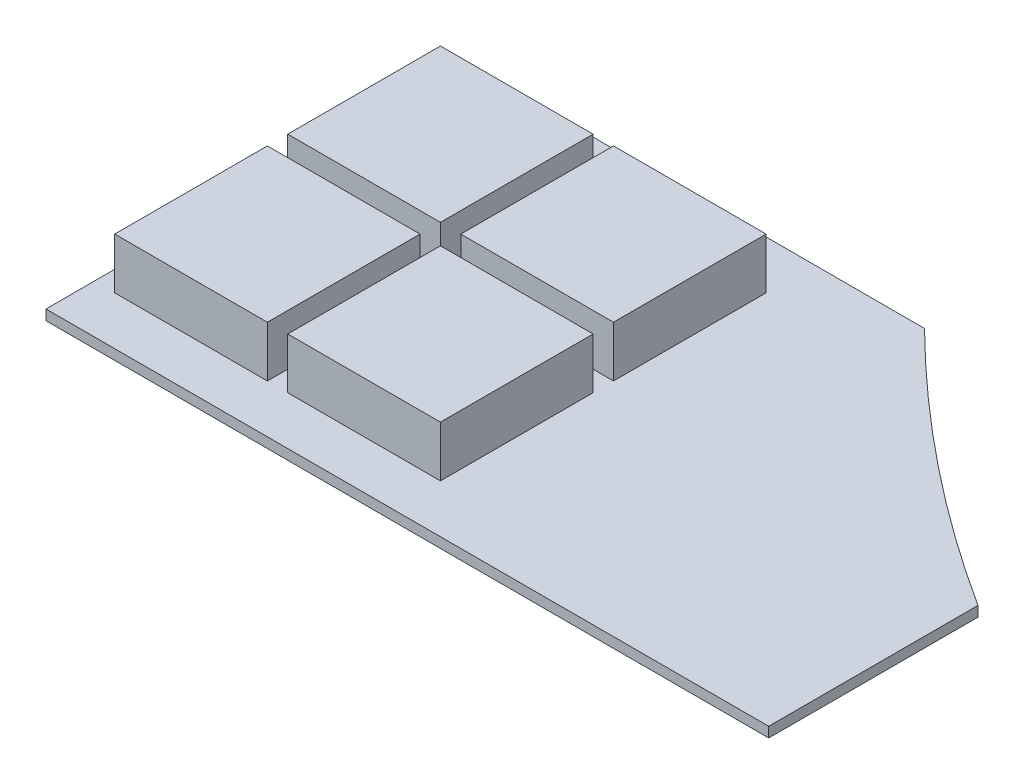
ISO-10303-21;
HEADER;
FILE_DESCRIPTION(('STEP AP214'),'2;1');
FILE_NAME('part.step','',(''),(''),'','','');
FILE_SCHEMA(('AUTOMOTIVE_DESIGN { 1 0 10303 214 1 1 1 1 }'));
ENDSEC;
DATA;
#1=APPLICATION_CONTEXT('core data for automotive mechanical design processes');
#2=APPLICATION_PROTOCOL_DEFINITION('international standard','automotive_design',2000,#1);
#3=PRODUCT_CONTEXT('',#1,'mechanical');
#4=PRODUCT('Part','Part','',(#3));
#5=PRODUCT_RELATED_PRODUCT_CATEGORY('part','',(#4));
#6=PRODUCT_DEFINITION_FORMATION('','',#4);
#7=PRODUCT_DEFINITION_CONTEXT('part definition',#1,'design');
#8=PRODUCT_DEFINITION('design','',#6,#7);
#9=PRODUCT_DEFINITION_SHAPE('','',#8);
#10=(LENGTH_UNIT() NAMED_UNIT(*) SI_UNIT(.MILLI.,.METRE.));
#11=(NAMED_UNIT(*) PLANE_ANGLE_UNIT() SI_UNIT($,.RADIAN.));
#12=(NAMED_UNIT(*) SI_UNIT($,.STERADIAN.) SOLID_ANGLE_UNIT());
#13=UNCERTAINTY_MEASURE_WITH_UNIT(LENGTH_MEASURE(1.E-05),#10,'distance_accuracy_value','');
#14=(GEOMETRIC_REPRESENTATION_CONTEXT(3) GLOBAL_UNCERTAINTY_ASSIGNED_CONTEXT((#13)) GLOBAL_UNIT_ASSIGNED_CONTEXT((#10,
#11,#12)) REPRESENTATION_CONTEXT('',''));
#15=CARTESIAN_POINT('',(0.,0.,0.));
#16=DIRECTION('',(0.,0.,1.));
#17=DIRECTION('',(1.,0.,0.));
#18=AXIS2_PLACEMENT_3D('',#15,#16,#17);
#19=CARTESIAN_POINT('',(211.09224857648,93.3157017452683,55.768969390047));
#20=DIRECTION('',(0.,1.,0.));
#21=DIRECTION('',(0.,0.,1.));
#22=AXIS2_PLACEMENT_3D('',#19,#20,#21);
#23=PLANE('',#22);
#24=DIRECTION('',(0.,0.,1.));
#25=VECTOR('',#24,1.);
#26=CARTESIAN_POINT('',(269.894917120642,93.3157017452683,82.4989117513526));
#27=LINE('',#26,#25);
#28=CARTESIAN_POINT('',(269.894917120642,93.3157017452683,97.4989117513526));
#29=VERTEX_POINT('',#28);
#30=CARTESIAN_POINT('',(269.894917120642,93.3157017452683,82.4989117513526));
#31=VERTEX_POINT('',#30);
#32=EDGE_CURVE('E305',#29,#31,#27,.F.);
#33=ORIENTED_EDGE('',*,*,#32,.F.);
#34=DIRECTION('',(1.,0.,0.));
#35=VECTOR('',#34,1.);
#36=CARTESIAN_POINT('',(269.894917120642,93.3157017452683,97.4989117513526));
#37=LINE('',#36,#35);
#38=CARTESIAN_POINT('',(284.894917120642,93.3157017452683,97.4989117513526));
#39=VERTEX_POINT('',#38);
#40=EDGE_CURVE('E136',#39,#29,#37,.F.);
#41=ORIENTED_EDGE('',*,*,#40,.F.);
#42=DIRECTION('',(0.,0.,-1.));
#43=VECTOR('',#42,1.);
#44=CARTESIAN_POINT('',(284.894917120642,93.3157017452683,97.4989117513526));
#45=LINE('',#44,#43);
#46=CARTESIAN_POINT('',(284.894917120642,93.3157017452683,82.4989117513526));
#47=VERTEX_POINT('',#46);
#48=EDGE_CURVE('E128',#47,#39,#45,.F.);
#49=ORIENTED_EDGE('',*,*,#48,.F.);
#50=DIRECTION('',(-1.,0.,0.));
#51=VECTOR('',#50,1.);
#52=CARTESIAN_POINT('',(284.894917120642,93.3157017452683,82.4989117513526));
#53=LINE('',#52,#51);
#54=EDGE_CURVE('E116',#31,#47,#53,.F.);
#55=ORIENTED_EDGE('',*,*,#54,.F.);
#56=EDGE_LOOP('',(#33,#41,#49,#55));
#57=FACE_BOUND('',#56,.T.);
#58=ADVANCED_FACE('F17',(#57),#23,.T.);
#59=CARTESIAN_POINT('',(194.09224857648,93.3157017452683,55.768969390047));
#60=DIRECTION('',(0.,1.,0.));
#61=DIRECTION('',(0.,0.,1.));
#62=AXIS2_PLACEMENT_3D('',#59,#60,#61);
#63=PLANE('',#62);
#64=DIRECTION('',(0.,0.,1.));
#65=VECTOR('',#64,1.);
#66=CARTESIAN_POINT('',(252.894917120642,93.3157017452683,82.4989117513526));
#67=LINE('',#66,#65);
#68=CARTESIAN_POINT('',(252.894917120642,93.3157017452683,97.4989117513526));
#69=VERTEX_POINT('',#68);
#70=CARTESIAN_POINT('',(252.894917120642,93.3157017452683,82.4989117513526));
#71=VERTEX_POINT('',#70);
#72=EDGE_CURVE('E299',#69,#71,#67,.F.);
#73=ORIENTED_EDGE('',*,*,#72,.F.);
#74=DIRECTION('',(1.,0.,0.));
#75=VECTOR('',#74,1.);
#76=CARTESIAN_POINT('',(252.894917120642,93.3157017452683,97.4989117513526));
#77=LINE('',#76,#75);
#78=CARTESIAN_POINT('',(267.894917120642,93.3157017452683,97.4989117513526));
#79=VERTEX_POINT('',#78);
#80=EDGE_CURVE('E287',#79,#69,#77,.F.);
#81=ORIENTED_EDGE('',*,*,#80,.F.);
#82=DIRECTION('',(0.,0.,-1.));
#83=VECTOR('',#82,1.);
#84=CARTESIAN_POINT('',(267.894917120642,93.3157017452683,97.4989117513526));
#85=LINE('',#84,#83);
#86=CARTESIAN_POINT('',(267.894917120642,93.3157017452683,82.4989117513526));
#87=VERTEX_POINT('',#86);
#88=EDGE_CURVE('E292',#87,#79,#85,.F.);
#89=ORIENTED_EDGE('',*,*,#88,.F.);
#90=DIRECTION('',(-1.,0.,0.));
#91=VECTOR('',#90,1.);
#92=CARTESIAN_POINT('',(267.894917120642,93.3157017452683,82.4989117513526));
#93=LINE('',#92,#91);
#94=EDGE_CURVE('E297',#71,#87,#93,.F.);
#95=ORIENTED_EDGE('',*,*,#94,.F.);
#96=EDGE_LOOP('',(#73,#81,#89,#95));
#97=FACE_BOUND('',#96,.T.);
#98=ADVANCED_FACE('F422',(#97),#63,.T.);
#99=CARTESIAN_POINT('',(211.09224857648,93.3157017452683,38.768969390047));
#100=DIRECTION('',(0.,1.,0.));
#101=DIRECTION('',(0.,0.,1.));
#102=AXIS2_PLACEMENT_3D('',#99,#100,#101);
#103=PLANE('',#102);
#104=DIRECTION('',(0.,0.,1.));
#105=VECTOR('',#104,1.);
#106=CARTESIAN_POINT('',(269.894917120642,93.3157017452683,65.4989117513526));
#107=LINE('',#106,#105);
#108=CARTESIAN_POINT('',(269.894917120642,93.3157017452683,80.4989117513526));
#109=VERTEX_POINT('',#108);
#110=CARTESIAN_POINT('',(269.894917120642,93.3157017452683,65.4989117513526));
#111=VERTEX_POINT('',#110);
#112=EDGE_CURVE('E272',#109,#111,#107,.F.);
#113=ORIENTED_EDGE('',*,*,#112,.F.);
#114=DIRECTION('',(1.,0.,0.));
#115=VECTOR('',#114,1.);
#116=CARTESIAN_POINT('',(269.894917120642,93.3157017452683,80.4989117513526));
#117=LINE('',#116,#115);
#118=CARTESIAN_POINT('',(284.894917120642,93.3157017452683,80.4989117513526));
#119=VERTEX_POINT('',#118);
#120=EDGE_CURVE('E277',#119,#109,#117,.F.);
#121=ORIENTED_EDGE('',*,*,#120,.F.);
#122=DIRECTION('',(0.,0.,-1.));
#123=VECTOR('',#122,1.);
#124=CARTESIAN_POINT('',(284.894917120642,93.3157017452683,80.4989117513526));
#125=LINE('',#124,#123);
#126=CARTESIAN_POINT('',(284.894917120642,93.3157017452683,65.4989117513526));
#127=VERTEX_POINT('',#126);
#128=EDGE_CURVE('E279',#127,#119,#125,.F.);
#129=ORIENTED_EDGE('',*,*,#128,.F.);
#130=DIRECTION('',(-1.,0.,0.));
#131=VECTOR('',#130,1.);
#132=CARTESIAN_POINT('',(284.894917120642,93.3157017452683,65.4989117513526));
#133=LINE('',#132,#131);
#134=EDGE_CURVE('E267',#111,#127,#133,.F.);
#135=ORIENTED_EDGE('',*,*,#134,.F.);
#136=EDGE_LOOP('',(#113,#121,#129,#135));
#137=FACE_BOUND('',#136,.T.);
#138=ADVANCED_FACE('F419',(#137),#103,.T.);
#139=CARTESIAN_POINT('',(194.09224857648,93.3157017452683,38.768969390047));
#140=DIRECTION('',(0.,1.,0.));
#141=DIRECTION('',(0.,0.,1.));
#142=AXIS2_PLACEMENT_3D('',#139,#140,#141);
#143=PLANE('',#142);
#144=DIRECTION('',(0.,0.,1.));
#145=VECTOR('',#144,1.);
#146=CARTESIAN_POINT('',(252.894917120642,93.3157017452683,65.4989117513526));
#147=LINE('',#146,#145);
#148=CARTESIAN_POINT('',(252.894917120642,93.3157017452683,80.4989117513526));
#149=VERTEX_POINT('',#148);
#150=CARTESIAN_POINT('',(252.894917120642,93.3157017452683,65.4989117513526));
#151=VERTEX_POINT('',#150);
#152=EDGE_CURVE('E259',#149,#151,#147,.F.);
#153=ORIENTED_EDGE('',*,*,#152,.F.);
#154=DIRECTION('',(1.,0.,0.));
#155=VECTOR('',#154,1.);
#156=CARTESIAN_POINT('',(252.894917120642,93.3157017452683,80.4989117513526));
#157=LINE('',#156,#155);
#158=CARTESIAN_POINT('',(267.894917120642,93.3157017452683,80.4989117513526));
#159=VERTEX_POINT('',#158);
#160=EDGE_CURVE('E247',#159,#149,#157,.F.);
#161=ORIENTED_EDGE('',*,*,#160,.F.);
#162=DIRECTION('',(0.,0.,-1.));
#163=VECTOR('',#162,1.);
#164=CARTESIAN_POINT('',(267.894917120642,93.3157017452683,80.4989117513526));
#165=LINE('',#164,#163);
#166=CARTESIAN_POINT('',(267.894917120642,93.3157017452683,65.4989117513526));
#167=VERTEX_POINT('',#166);
#168=EDGE_CURVE('E252',#167,#159,#165,.F.);
#169=ORIENTED_EDGE('',*,*,#168,.F.);
#170=DIRECTION('',(-1.,0.,0.));
#171=VECTOR('',#170,1.);
#172=CARTESIAN_POINT('',(267.894917120642,93.3157017452683,65.4989117513526));
#173=LINE('',#172,#171);
#174=EDGE_CURVE('E257',#151,#167,#173,.F.);
#175=ORIENTED_EDGE('',*,*,#174,.F.);
#176=EDGE_LOOP('',(#153,#161,#169,#175));
#177=FACE_BOUND('',#176,.T.);
#178=ADVANCED_FACE('F416',(#177),#143,.T.);
#179=CARTESIAN_POINT('',(284.894917120642,93.3157017452683,82.4989117513526));
#180=DIRECTION('',(0.,0.,-1.));
#181=DIRECTION('',(-1.,0.,0.));
#182=AXIS2_PLACEMENT_3D('',#179,#180,#181);
#183=PLANE('',#182);
#184=DIRECTION('',(1.,0.,0.));
#185=VECTOR('',#184,1.);
#186=CARTESIAN_POINT('',(627.09224857648,88.3157017452683,82.4989117513526));
#187=LINE('',#186,#185);
#188=CARTESIAN_POINT('',(269.894917120642,88.3157017452683,82.4989117513526));
#189=VERTEX_POINT('',#188);
#190=CARTESIAN_POINT('',(284.894917120642,88.3157017452683,82.4989117513526));
#191=VERTEX_POINT('',#190);
#192=EDGE_CURVE('E226',#189,#191,#187,.T.);
#193=ORIENTED_EDGE('',*,*,#192,.F.);
#194=DIRECTION('',(0.,1.,0.));
#195=VECTOR('',#194,1.);
#196=CARTESIAN_POINT('',(269.894917120642,93.3157017452683,82.4989117513526));
#197=LINE('',#196,#195);
#198=EDGE_CURVE('E124',#31,#189,#197,.F.);
#199=ORIENTED_EDGE('',*,*,#198,.F.);
#200=ORIENTED_EDGE('',*,*,#54,.T.);
#201=DIRECTION('',(0.,1.,0.));
#202=VECTOR('',#201,1.);
#203=CARTESIAN_POINT('',(284.894917120642,93.3157017452683,82.4989117513526));
#204=LINE('',#203,#202);
#205=EDGE_CURVE('E121',#191,#47,#204,.T.);
#206=ORIENTED_EDGE('',*,*,#205,.F.);
#207=EDGE_LOOP('',(#193,#199,#200,#206));
#208=FACE_BOUND('',#207,.T.);
#209=ADVANCED_FACE('F119',(#208),#183,.T.);
#210=CARTESIAN_POINT('',(284.894917120642,93.3157017452683,97.4989117513526));
#211=DIRECTION('',(1.,0.,0.));
#212=DIRECTION('',(0.,0.,-1.));
#213=AXIS2_PLACEMENT_3D('',#210,#211,#212);
#214=PLANE('',#213);
#215=DIRECTION('',(0.,0.,1.));
#216=VECTOR('',#215,1.);
#217=CARTESIAN_POINT('',(284.894917120642,88.3157017452683,38.768969390047));
#218=LINE('',#217,#216);
#219=CARTESIAN_POINT('',(284.894917120642,88.3157017452683,97.4989117513526));
#220=VERTEX_POINT('',#219);
#221=EDGE_CURVE('E135',#191,#220,#218,.T.);
#222=ORIENTED_EDGE('',*,*,#221,.F.);
#223=ORIENTED_EDGE('',*,*,#205,.T.);
#224=ORIENTED_EDGE('',*,*,#48,.T.);
#225=DIRECTION('',(0.,1.,0.));
#226=VECTOR('',#225,1.);
#227=CARTESIAN_POINT('',(284.894917120642,93.3157017452683,97.4989117513526));
#228=LINE('',#227,#226);
#229=EDGE_CURVE('E307',#220,#39,#228,.T.);
#230=ORIENTED_EDGE('',*,*,#229,.F.);
#231=EDGE_LOOP('',(#222,#223,#224,#230));
#232=FACE_BOUND('',#231,.T.);
#233=ADVANCED_FACE('F131',(#232),#214,.T.);
#234=CARTESIAN_POINT('',(269.894917120642,93.3157017452683,97.4989117513526));
#235=DIRECTION('',(0.,0.,1.));
#236=DIRECTION('',(1.,0.,0.));
#237=AXIS2_PLACEMENT_3D('',#234,#235,#236);
#238=PLANE('',#237);
#239=DIRECTION('',(1.,0.,0.));
#240=VECTOR('',#239,1.);
#241=CARTESIAN_POINT('',(627.09224857648,88.3157017452683,97.4989117513526));
#242=LINE('',#241,#240);
#243=CARTESIAN_POINT('',(269.894917120642,88.3157017452683,97.4989117513526));
#244=VERTEX_POINT('',#243);
#245=EDGE_CURVE('E222',#220,#244,#242,.F.);
#246=ORIENTED_EDGE('',*,*,#245,.F.);
#247=ORIENTED_EDGE('',*,*,#229,.T.);
#248=ORIENTED_EDGE('',*,*,#40,.T.);
#249=DIRECTION('',(0.,1.,0.));
#250=VECTOR('',#249,1.);
#251=CARTESIAN_POINT('',(269.894917120642,93.3157017452683,97.4989117513526));
#252=LINE('',#251,#250);
#253=EDGE_CURVE('E301',#244,#29,#252,.T.);
#254=ORIENTED_EDGE('',*,*,#253,.F.);
#255=EDGE_LOOP('',(#246,#247,#248,#254));
#256=FACE_BOUND('',#255,.T.);
#257=ADVANCED_FACE('F311',(#256),#238,.T.);
#258=CARTESIAN_POINT('',(269.894917120642,93.3157017452683,82.4989117513526));
#259=DIRECTION('',(-1.,0.,0.));
#260=DIRECTION('',(0.,0.,1.));
#261=AXIS2_PLACEMENT_3D('',#258,#259,#260);
#262=PLANE('',#261);
#263=DIRECTION('',(0.,0.,1.));
#264=VECTOR('',#263,1.);
#265=CARTESIAN_POINT('',(269.894917120642,88.3157017452683,38.768969390047));
#266=LINE('',#265,#264);
#267=EDGE_CURVE('E219',#244,#189,#266,.F.);
#268=ORIENTED_EDGE('',*,*,#267,.F.);
#269=ORIENTED_EDGE('',*,*,#253,.T.);
#270=ORIENTED_EDGE('',*,*,#32,.T.);
#271=ORIENTED_EDGE('',*,*,#198,.T.);
#272=EDGE_LOOP('',(#268,#269,#270,#271));
#273=FACE_BOUND('',#272,.T.);
#274=ADVANCED_FACE('F315',(#273),#262,.T.);
#275=CARTESIAN_POINT('',(252.894917120642,93.3157017452683,82.4989117513526));
#276=DIRECTION('',(-1.,0.,0.));
#277=DIRECTION('',(0.,0.,1.));
#278=AXIS2_PLACEMENT_3D('',#275,#276,#277);
#279=PLANE('',#278);
#280=DIRECTION('',(0.,0.,1.));
#281=VECTOR('',#280,1.);
#282=CARTESIAN_POINT('',(252.894917120642,88.3157017452683,38.768969390047));
#283=LINE('',#282,#281);
#284=CARTESIAN_POINT('',(252.894917120642,88.3157017452683,97.4989117513526));
#285=VERTEX_POINT('',#284);
#286=CARTESIAN_POINT('',(252.894917120642,88.3157017452683,82.4989117513526));
#287=VERTEX_POINT('',#286);
#288=EDGE_CURVE('E216',#285,#287,#283,.F.);
#289=ORIENTED_EDGE('',*,*,#288,.F.);
#290=DIRECTION('',(0.,1.,0.));
#291=VECTOR('',#290,1.);
#292=CARTESIAN_POINT('',(252.894917120642,93.3157017452683,97.4989117513526));
#293=LINE('',#292,#291);
#294=EDGE_CURVE('E284',#69,#285,#293,.F.);
#295=ORIENTED_EDGE('',*,*,#294,.F.);
#296=ORIENTED_EDGE('',*,*,#72,.T.);
#297=DIRECTION('',(0.,1.,0.));
#298=VECTOR('',#297,1.);
#299=CARTESIAN_POINT('',(252.894917120642,93.3157017452683,82.4989117513526));
#300=LINE('',#299,#298);
#301=EDGE_CURVE('E294',#287,#71,#300,.T.);
#302=ORIENTED_EDGE('',*,*,#301,.F.);
#303=EDGE_LOOP('',(#289,#295,#296,#302));
#304=FACE_BOUND('',#303,.T.);
#305=ADVANCED_FACE('F403',(#304),#279,.T.);
#306=CARTESIAN_POINT('',(267.894917120642,93.3157017452683,82.4989117513526));
#307=DIRECTION('',(0.,0.,-1.));
#308=DIRECTION('',(-1.,0.,0.));
#309=AXIS2_PLACEMENT_3D('',#306,#307,#308);
#310=PLANE('',#309);
#311=DIRECTION('',(1.,0.,0.));
#312=VECTOR('',#311,1.);
#313=CARTESIAN_POINT('',(627.09224857648,88.3157017452683,82.4989117513526));
#314=LINE('',#313,#312);
#315=CARTESIAN_POINT('',(267.894917120642,88.3157017452683,82.4989117513526));
#316=VERTEX_POINT('',#315);
#317=EDGE_CURVE('E213',#287,#316,#314,.T.);
#318=ORIENTED_EDGE('',*,*,#317,.F.);
#319=ORIENTED_EDGE('',*,*,#301,.T.);
#320=ORIENTED_EDGE('',*,*,#94,.T.);
#321=DIRECTION('',(0.,1.,0.));
#322=VECTOR('',#321,1.);
#323=CARTESIAN_POINT('',(267.894917120642,93.3157017452683,82.4989117513526));
#324=LINE('',#323,#322);
#325=EDGE_CURVE('E289',#316,#87,#324,.T.);
#326=ORIENTED_EDGE('',*,*,#325,.F.);
#327=EDGE_LOOP('',(#318,#319,#320,#326));
#328=FACE_BOUND('',#327,.T.);
#329=ADVANCED_FACE('F399',(#328),#310,.T.);
#330=CARTESIAN_POINT('',(267.894917120642,93.3157017452683,97.4989117513526));
#331=DIRECTION('',(1.,0.,0.));
#332=DIRECTION('',(0.,0.,-1.));
#333=AXIS2_PLACEMENT_3D('',#330,#331,#332);
#334=PLANE('',#333);
#335=DIRECTION('',(0.,0.,1.));
#336=VECTOR('',#335,1.);
#337=CARTESIAN_POINT('',(267.894917120642,88.3157017452683,38.768969390047));
#338=LINE('',#337,#336);
#339=CARTESIAN_POINT('',(267.894917120642,88.3157017452683,97.4989117513526));
#340=VERTEX_POINT('',#339);
#341=EDGE_CURVE('E210',#316,#340,#338,.T.);
#342=ORIENTED_EDGE('',*,*,#341,.F.);
#343=ORIENTED_EDGE('',*,*,#325,.T.);
#344=ORIENTED_EDGE('',*,*,#88,.T.);
#345=DIRECTION('',(0.,1.,0.));
#346=VECTOR('',#345,1.);
#347=CARTESIAN_POINT('',(267.894917120642,93.3157017452683,97.4989117513526));
#348=LINE('',#347,#346);
#349=EDGE_CURVE('E281',#340,#79,#348,.T.);
#350=ORIENTED_EDGE('',*,*,#349,.F.);
#351=EDGE_LOOP('',(#342,#343,#344,#350));
#352=FACE_BOUND('',#351,.T.);
#353=ADVANCED_FACE('F395',(#352),#334,.T.);
#354=CARTESIAN_POINT('',(252.894917120642,93.3157017452683,97.4989117513526));
#355=DIRECTION('',(0.,0.,1.));
#356=DIRECTION('',(1.,0.,0.));
#357=AXIS2_PLACEMENT_3D('',#354,#355,#356);
#358=PLANE('',#357);
#359=DIRECTION('',(1.,0.,0.));
#360=VECTOR('',#359,1.);
#361=CARTESIAN_POINT('',(627.09224857648,88.3157017452683,97.4989117513526));
#362=LINE('',#361,#360);
#363=EDGE_CURVE('E207',#340,#285,#362,.F.);
#364=ORIENTED_EDGE('',*,*,#363,.F.);
#365=ORIENTED_EDGE('',*,*,#349,.T.);
#366=ORIENTED_EDGE('',*,*,#80,.T.);
#367=ORIENTED_EDGE('',*,*,#294,.T.);
#368=EDGE_LOOP('',(#364,#365,#366,#367));
#369=FACE_BOUND('',#368,.T.);
#370=ADVANCED_FACE('F391',(#369),#358,.T.);
#371=CARTESIAN_POINT('',(284.894917120642,93.3157017452683,80.4989117513526));
#372=DIRECTION('',(1.,0.,0.));
#373=DIRECTION('',(0.,0.,-1.));
#374=AXIS2_PLACEMENT_3D('',#371,#372,#373);
#375=PLANE('',#374);
#376=DIRECTION('',(0.,0.,1.));
#377=VECTOR('',#376,1.);
#378=CARTESIAN_POINT('',(284.894917120642,88.3157017452683,38.768969390047));
#379=LINE('',#378,#377);
#380=CARTESIAN_POINT('',(284.894917120642,88.3157017452683,65.4989117513526));
#381=VERTEX_POINT('',#380);
#382=CARTESIAN_POINT('',(284.894917120642,88.3157017452683,80.4989117513526));
#383=VERTEX_POINT('',#382);
#384=EDGE_CURVE('E204',#381,#383,#379,.T.);
#385=ORIENTED_EDGE('',*,*,#384,.F.);
#386=DIRECTION('',(0.,1.,0.));
#387=VECTOR('',#386,1.);
#388=CARTESIAN_POINT('',(284.894917120642,93.3157017452683,65.4989117513526));
#389=LINE('',#388,#387);
#390=EDGE_CURVE('E264',#127,#381,#389,.F.);
#391=ORIENTED_EDGE('',*,*,#390,.F.);
#392=ORIENTED_EDGE('',*,*,#128,.T.);
#393=DIRECTION('',(0.,1.,0.));
#394=VECTOR('',#393,1.);
#395=CARTESIAN_POINT('',(284.894917120642,93.3157017452683,80.4989117513526));
#396=LINE('',#395,#394);
#397=EDGE_CURVE('E274',#383,#119,#396,.T.);
#398=ORIENTED_EDGE('',*,*,#397,.F.);
#399=EDGE_LOOP('',(#385,#391,#392,#398));
#400=FACE_BOUND('',#399,.T.);
#401=ADVANCED_FACE('F387',(#400),#375,.T.);
#402=CARTESIAN_POINT('',(269.894917120642,93.3157017452683,80.4989117513526));
#403=DIRECTION('',(0.,0.,1.));
#404=DIRECTION('',(1.,0.,0.));
#405=AXIS2_PLACEMENT_3D('',#402,#403,#404);
#406=PLANE('',#405);
#407=DIRECTION('',(1.,0.,0.));
#408=VECTOR('',#407,1.);
#409=CARTESIAN_POINT('',(627.09224857648,88.3157017452683,80.4989117513526));
#410=LINE('',#409,#408);
#411=CARTESIAN_POINT('',(269.894917120642,88.3157017452683,80.4989117513526));
#412=VERTEX_POINT('',#411);
#413=EDGE_CURVE('E201',#383,#412,#410,.F.);
#414=ORIENTED_EDGE('',*,*,#413,.F.);
#415=ORIENTED_EDGE('',*,*,#397,.T.);
#416=ORIENTED_EDGE('',*,*,#120,.T.);
#417=DIRECTION('',(0.,1.,0.));
#418=VECTOR('',#417,1.);
#419=CARTESIAN_POINT('',(269.894917120642,93.3157017452683,80.4989117513526));
#420=LINE('',#419,#418);
#421=EDGE_CURVE('E269',#412,#109,#420,.T.);
#422=ORIENTED_EDGE('',*,*,#421,.F.);
#423=EDGE_LOOP('',(#414,#415,#416,#422));
#424=FACE_BOUND('',#423,.T.);
#425=ADVANCED_FACE('F383',(#424),#406,.T.);
#426=CARTESIAN_POINT('',(269.894917120642,93.3157017452683,65.4989117513526));
#427=DIRECTION('',(-1.,0.,0.));
#428=DIRECTION('',(0.,0.,1.));
#429=AXIS2_PLACEMENT_3D('',#426,#427,#428);
#430=PLANE('',#429);
#431=DIRECTION('',(0.,0.,1.));
#432=VECTOR('',#431,1.);
#433=CARTESIAN_POINT('',(269.894917120642,88.3157017452683,38.768969390047));
#434=LINE('',#433,#432);
#435=CARTESIAN_POINT('',(269.894917120642,88.3157017452683,65.4989117513526));
#436=VERTEX_POINT('',#435);
#437=EDGE_CURVE('E198',#412,#436,#434,.F.);
#438=ORIENTED_EDGE('',*,*,#437,.F.);
#439=ORIENTED_EDGE('',*,*,#421,.T.);
#440=ORIENTED_EDGE('',*,*,#112,.T.);
#441=DIRECTION('',(0.,1.,0.));
#442=VECTOR('',#441,1.);
#443=CARTESIAN_POINT('',(269.894917120642,93.3157017452683,65.4989117513526));
#444=LINE('',#443,#442);
#445=EDGE_CURVE('E261',#436,#111,#444,.T.);
#446=ORIENTED_EDGE('',*,*,#445,.F.);
#447=EDGE_LOOP('',(#438,#439,#440,#446));
#448=FACE_BOUND('',#447,.T.);
#449=ADVANCED_FACE('F379',(#448),#430,.T.);
#450=CARTESIAN_POINT('',(284.894917120642,93.3157017452683,65.4989117513526));
#451=DIRECTION('',(0.,0.,-1.));
#452=DIRECTION('',(-1.,0.,0.));
#453=AXIS2_PLACEMENT_3D('',#450,#451,#452);
#454=PLANE('',#453);
#455=DIRECTION('',(1.,0.,0.));
#456=VECTOR('',#455,1.);
#457=CARTESIAN_POINT('',(627.09224857648,88.3157017452683,65.4989117513526));
#458=LINE('',#457,#456);
#459=EDGE_CURVE('E195',#436,#381,#458,.T.);
#460=ORIENTED_EDGE('',*,*,#459,.F.);
#461=ORIENTED_EDGE('',*,*,#445,.T.);
#462=ORIENTED_EDGE('',*,*,#134,.T.);
#463=ORIENTED_EDGE('',*,*,#390,.T.);
#464=EDGE_LOOP('',(#460,#461,#462,#463));
#465=FACE_BOUND('',#464,.T.);
#466=ADVANCED_FACE('F375',(#465),#454,.T.);
#467=CARTESIAN_POINT('',(252.894917120642,93.3157017452683,65.4989117513526));
#468=DIRECTION('',(-1.,0.,0.));
#469=DIRECTION('',(0.,0.,1.));
#470=AXIS2_PLACEMENT_3D('',#467,#468,#469);
#471=PLANE('',#470);
#472=DIRECTION('',(0.,0.,1.));
#473=VECTOR('',#472,1.);
#474=CARTESIAN_POINT('',(252.894917120642,88.3157017452683,38.768969390047));
#475=LINE('',#474,#473);
#476=CARTESIAN_POINT('',(252.894917120642,88.3157017452683,80.4989117513526));
#477=VERTEX_POINT('',#476);
#478=CARTESIAN_POINT('',(252.894917120642,88.3157017452683,65.4989117513526));
#479=VERTEX_POINT('',#478);
#480=EDGE_CURVE('E192',#477,#479,#475,.F.);
#481=ORIENTED_EDGE('',*,*,#480,.F.);
#482=DIRECTION('',(0.,1.,0.));
#483=VECTOR('',#482,1.);
#484=CARTESIAN_POINT('',(252.894917120642,93.3157017452683,80.4989117513526));
#485=LINE('',#484,#483);
#486=EDGE_CURVE('E244',#149,#477,#485,.F.);
#487=ORIENTED_EDGE('',*,*,#486,.F.);
#488=ORIENTED_EDGE('',*,*,#152,.T.);
#489=DIRECTION('',(0.,1.,0.));
#490=VECTOR('',#489,1.);
#491=CARTESIAN_POINT('',(252.894917120642,93.3157017452683,65.4989117513526));
#492=LINE('',#491,#490);
#493=EDGE_CURVE('E254',#479,#151,#492,.T.);
#494=ORIENTED_EDGE('',*,*,#493,.F.);
#495=EDGE_LOOP('',(#481,#487,#488,#494));
#496=FACE_BOUND('',#495,.T.);
#497=ADVANCED_FACE('F371',(#496),#471,.T.);
#498=CARTESIAN_POINT('',(267.894917120642,93.3157017452683,65.4989117513526));
#499=DIRECTION('',(0.,0.,-1.));
#500=DIRECTION('',(-1.,0.,0.));
#501=AXIS2_PLACEMENT_3D('',#498,#499,#500);
#502=PLANE('',#501);
#503=DIRECTION('',(1.,0.,0.));
#504=VECTOR('',#503,1.);
#505=CARTESIAN_POINT('',(627.09224857648,88.3157017452683,65.4989117513526));
#506=LINE('',#505,#504);
#507=CARTESIAN_POINT('',(267.894917120642,88.3157017452683,65.4989117513526));
#508=VERTEX_POINT('',#507);
#509=EDGE_CURVE('E189',#479,#508,#506,.T.);
#510=ORIENTED_EDGE('',*,*,#509,.F.);
#511=ORIENTED_EDGE('',*,*,#493,.T.);
#512=ORIENTED_EDGE('',*,*,#174,.T.);
#513=DIRECTION('',(0.,1.,0.));
#514=VECTOR('',#513,1.);
#515=CARTESIAN_POINT('',(267.894917120642,93.3157017452683,65.4989117513526));
#516=LINE('',#515,#514);
#517=EDGE_CURVE('E249',#508,#167,#516,.T.);
#518=ORIENTED_EDGE('',*,*,#517,.F.);
#519=EDGE_LOOP('',(#510,#511,#512,#518));
#520=FACE_BOUND('',#519,.T.);
#521=ADVANCED_FACE('F367',(#520),#502,.T.);
#522=CARTESIAN_POINT('',(267.894917120642,93.3157017452683,80.4989117513526));
#523=DIRECTION('',(1.,0.,0.));
#524=DIRECTION('',(0.,0.,-1.));
#525=AXIS2_PLACEMENT_3D('',#522,#523,#524);
#526=PLANE('',#525);
#527=DIRECTION('',(0.,0.,1.));
#528=VECTOR('',#527,1.);
#529=CARTESIAN_POINT('',(267.894917120642,88.3157017452683,38.768969390047));
#530=LINE('',#529,#528);
#531=CARTESIAN_POINT('',(267.894917120642,88.3157017452683,80.4989117513526));
#532=VERTEX_POINT('',#531);
#533=EDGE_CURVE('E186',#508,#532,#530,.T.);
#534=ORIENTED_EDGE('',*,*,#533,.F.);
#535=ORIENTED_EDGE('',*,*,#517,.T.);
#536=ORIENTED_EDGE('',*,*,#168,.T.);
#537=DIRECTION('',(0.,1.,0.));
#538=VECTOR('',#537,1.);
#539=CARTESIAN_POINT('',(267.894917120642,93.3157017452683,80.4989117513526));
#540=LINE('',#539,#538);
#541=EDGE_CURVE('E229',#532,#159,#540,.T.);
#542=ORIENTED_EDGE('',*,*,#541,.F.);
#543=EDGE_LOOP('',(#534,#535,#536,#542));
#544=FACE_BOUND('',#543,.T.);
#545=ADVANCED_FACE('F363',(#544),#526,.T.);
#546=CARTESIAN_POINT('',(252.894917120642,93.3157017452683,80.4989117513526));
#547=DIRECTION('',(0.,0.,1.));
#548=DIRECTION('',(1.,0.,0.));
#549=AXIS2_PLACEMENT_3D('',#546,#547,#548);
#550=PLANE('',#549);
#551=DIRECTION('',(1.,0.,0.));
#552=VECTOR('',#551,1.);
#553=CARTESIAN_POINT('',(627.09224857648,88.3157017452683,80.4989117513526));
#554=LINE('',#553,#552);
#555=EDGE_CURVE('E182',#532,#477,#554,.F.);
#556=ORIENTED_EDGE('',*,*,#555,.F.);
#557=ORIENTED_EDGE('',*,*,#541,.T.);
#558=ORIENTED_EDGE('',*,*,#160,.T.);
#559=ORIENTED_EDGE('',*,*,#486,.T.);
#560=EDGE_LOOP('',(#556,#557,#558,#559));
#561=FACE_BOUND('',#560,.T.);
#562=ADVANCED_FACE('F359',(#561),#550,.T.);
#563=CARTESIAN_POINT('',(627.09224857648,88.3157017452683,38.768969390047));
#564=DIRECTION('',(0.,1.,0.));
#565=DIRECTION('',(0.,0.,1.));
#566=AXIS2_PLACEMENT_3D('',#563,#564,#565);
#567=PLANE('',#566);
#568=ORIENTED_EDGE('',*,*,#533,.T.);
#569=ORIENTED_EDGE('',*,*,#555,.T.);
#570=ORIENTED_EDGE('',*,*,#480,.T.);
#571=ORIENTED_EDGE('',*,*,#509,.T.);
#572=EDGE_LOOP('',(#568,#569,#570,#571));
#573=FACE_BOUND('',#572,.T.);
#574=ORIENTED_EDGE('',*,*,#437,.T.);
#575=ORIENTED_EDGE('',*,*,#459,.T.);
#576=ORIENTED_EDGE('',*,*,#384,.T.);
#577=ORIENTED_EDGE('',*,*,#413,.T.);
#578=EDGE_LOOP('',(#574,#575,#576,#577));
#579=FACE_BOUND('',#578,.T.);
#580=ORIENTED_EDGE('',*,*,#341,.T.);
#581=ORIENTED_EDGE('',*,*,#363,.T.);
#582=ORIENTED_EDGE('',*,*,#288,.T.);
#583=ORIENTED_EDGE('',*,*,#317,.T.);
#584=EDGE_LOOP('',(#580,#581,#582,#583));
#585=FACE_BOUND('',#584,.T.);
#586=ORIENTED_EDGE('',*,*,#245,.T.);
#587=ORIENTED_EDGE('',*,*,#267,.T.);
#588=ORIENTED_EDGE('',*,*,#192,.T.);
#589=ORIENTED_EDGE('',*,*,#221,.T.);
#590=EDGE_LOOP('',(#586,#587,#588,#589));
#591=FACE_BOUND('',#590,.T.);
#592=DIRECTION('',(0.,0.,-1.));
#593=VECTOR('',#592,1.);
#594=CARTESIAN_POINT('',(321.894917120642,88.3157017452683,81.6867490338913));
#595=LINE('',#594,#593);
#596=CARTESIAN_POINT('',(321.894917120642,88.3157017452683,81.6867490338912));
#597=VERTEX_POINT('',#596);
#598=CARTESIAN_POINT('',(321.894917120642,88.3157017452683,102.248911751353));
#599=VERTEX_POINT('',#598);
#600=EDGE_CURVE('E47',#597,#599,#595,.F.);
#601=ORIENTED_EDGE('',*,*,#600,.F.);
#602=CARTESIAN_POINT('',(406.894917120642,88.3157017452683,-51.5010882486474));
#603=DIRECTION('',(0.,1.,0.));
#604=DIRECTION('',(0.,0.,1.));
#605=AXIS2_PLACEMENT_3D('',#602,#603,#604);
#606=CIRCLE('',#605,158.);
#607=CARTESIAN_POINT('',(295.701673171201,88.3157017452683,60.7489117513526));
#608=VERTEX_POINT('',#607);
#609=EDGE_CURVE('E20',#597,#608,#606,.F.);
#610=ORIENTED_EDGE('',*,*,#609,.T.);
#611=DIRECTION('',(-1.,0.,0.));
#612=VECTOR('',#611,1.);
#613=CARTESIAN_POINT('',(234.762444,88.3157017452683,60.7489117513526));
#614=LINE('',#613,#612);
#615=CARTESIAN_POINT('',(250.894917120642,88.3157017452683,60.7489117513526));
#616=VERTEX_POINT('',#615);
#617=EDGE_CURVE('E161',#616,#608,#614,.F.);
#618=ORIENTED_EDGE('',*,*,#617,.F.);
#619=DIRECTION('',(0.,0.,1.));
#620=VECTOR('',#619,1.);
#621=CARTESIAN_POINT('',(250.894917120642,88.3157017452683,111.498911751353));
#622=LINE('',#621,#620);
#623=CARTESIAN_POINT('',(250.894917120642,88.3157017452683,102.248911751353));
#624=VERTEX_POINT('',#623);
#625=EDGE_CURVE('E185',#624,#616,#622,.F.);
#626=ORIENTED_EDGE('',*,*,#625,.F.);
#627=DIRECTION('',(1.,0.,0.));
#628=VECTOR('',#627,1.);
#629=CARTESIAN_POINT('',(716.961413,88.3157017452683,102.248911751353));
#630=LINE('',#629,#628);
#631=EDGE_CURVE('E179',#599,#624,#630,.F.);
#632=ORIENTED_EDGE('',*,*,#631,.F.);
#633=EDGE_LOOP('',(#601,#610,#618,#626,#632));
#634=FACE_BOUND('',#633,.T.);
#635=ADVANCED_FACE('F320',(#573,#579,#585,#591,#634),#567,.T.);
#636=CARTESIAN_POINT('',(250.894917120642,87.3157017452683,111.498911751353));
#637=DIRECTION('',(-1.,0.,0.));
#638=DIRECTION('',(0.,0.,1.));
#639=AXIS2_PLACEMENT_3D('',#636,#637,#638);
#640=PLANE('',#639);
#641=DIRECTION('',(0.,1.,0.));
#642=VECTOR('',#641,1.);
#643=CARTESIAN_POINT('',(250.894917120642,86.7156777452683,102.248911751353));
#644=LINE('',#643,#642);
#645=CARTESIAN_POINT('',(250.894917120642,87.3157017452683,102.248911751353));
#646=VERTEX_POINT('',#645);
#647=EDGE_CURVE('E176',#624,#646,#644,.F.);
#648=ORIENTED_EDGE('',*,*,#647,.F.);
#649=ORIENTED_EDGE('',*,*,#625,.T.);
#650=DIRECTION('',(0.,1.,0.));
#651=VECTOR('',#650,1.);
#652=CARTESIAN_POINT('',(250.894917120642,86.7156777452683,60.7489117513526));
#653=LINE('',#652,#651);
#654=CARTESIAN_POINT('',(250.894917120642,87.3157017452683,60.7489117513526));
#655=VERTEX_POINT('',#654);
#656=EDGE_CURVE('E158',#655,#616,#653,.T.);
#657=ORIENTED_EDGE('',*,*,#656,.F.);
#658=DIRECTION('',(0.,0.,1.));
#659=VECTOR('',#658,1.);
#660=CARTESIAN_POINT('',(250.894917120642,87.3157017452683,38.768969390047));
#661=LINE('',#660,#659);
#662=EDGE_CURVE('E150',#655,#646,#661,.T.);
#663=ORIENTED_EDGE('',*,*,#662,.T.);
#664=EDGE_LOOP('',(#648,#649,#657,#663));
#665=FACE_BOUND('',#664,.T.);
#666=ADVANCED_FACE('F336',(#665),#640,.T.);
#667=CARTESIAN_POINT('',(716.961413,86.7156777452683,102.248911751353));
#668=DIRECTION('',(0.,0.,1.));
#669=DIRECTION('',(1.,0.,0.));
#670=AXIS2_PLACEMENT_3D('',#667,#668,#669);
#671=PLANE('',#670);
#672=ORIENTED_EDGE('',*,*,#647,.T.);
#673=DIRECTION('',(1.,0.,0.));
#674=VECTOR('',#673,1.);
#675=CARTESIAN_POINT('',(627.09224857648,87.3157017452683,102.248911751353));
#676=LINE('',#675,#674);
#677=CARTESIAN_POINT('',(321.894917120642,87.3157017452683,102.248911751353));
#678=VERTEX_POINT('',#677);
#679=EDGE_CURVE('E146',#646,#678,#676,.T.);
#680=ORIENTED_EDGE('',*,*,#679,.T.);
#681=DIRECTION('',(0.,1.,0.));
#682=VECTOR('',#681,1.);
#683=CARTESIAN_POINT('',(321.894917120642,87.3157017452683,102.248911751353));
#684=LINE('',#683,#682);
#685=EDGE_CURVE('E170',#599,#678,#684,.F.);
#686=ORIENTED_EDGE('',*,*,#685,.F.);
#687=ORIENTED_EDGE('',*,*,#631,.T.);
#688=EDGE_LOOP('',(#672,#680,#686,#687));
#689=FACE_BOUND('',#688,.T.);
#690=ADVANCED_FACE('F330',(#689),#671,.T.);
#691=CARTESIAN_POINT('',(321.894917120642,87.3157017452683,81.6867490338913));
#692=DIRECTION('',(1.,0.,0.));
#693=DIRECTION('',(0.,0.,-1.));
#694=AXIS2_PLACEMENT_3D('',#691,#692,#693);
#695=PLANE('',#694);
#696=ORIENTED_EDGE('',*,*,#600,.T.);
#697=ORIENTED_EDGE('',*,*,#685,.T.);
#698=DIRECTION('',(0.,0.,1.));
#699=VECTOR('',#698,1.);
#700=CARTESIAN_POINT('',(321.894917120642,87.3157017452683,38.768969390047));
#701=LINE('',#700,#699);
#702=CARTESIAN_POINT('',(321.894917120642,87.3157017452683,81.6867490338912));
#703=VERTEX_POINT('',#702);
#704=EDGE_CURVE('E142',#678,#703,#701,.F.);
#705=ORIENTED_EDGE('',*,*,#704,.T.);
#706=DIRECTION('',(0.,1.,0.));
#707=VECTOR('',#706,1.);
#708=CARTESIAN_POINT('',(321.894917120642,87.3157017452683,81.6867490338912));
#709=LINE('',#708,#707);
#710=EDGE_CURVE('E168',#703,#597,#709,.T.);
#711=ORIENTED_EDGE('',*,*,#710,.T.);
#712=EDGE_LOOP('',(#696,#697,#705,#711));
#713=FACE_BOUND('',#712,.T.);
#714=ADVANCED_FACE('F348',(#713),#695,.T.);
#715=CARTESIAN_POINT('',(406.894917120642,87.3157017452683,-51.5010882486474));
#716=DIRECTION('',(0.,1.,0.));
#717=DIRECTION('',(0.,0.,1.));
#718=AXIS2_PLACEMENT_3D('',#715,#716,#717);
#719=CYLINDRICAL_SURFACE('',#718,158.);
#720=DIRECTION('',(0.,1.,0.));
#721=VECTOR('',#720,1.);
#722=CARTESIAN_POINT('',(295.701673171201,86.7156777452683,60.7489117513526));
#723=LINE('',#722,#721);
#724=CARTESIAN_POINT('',(295.701673171201,87.3157017452683,60.7489117513526));
#725=VERTEX_POINT('',#724);
#726=EDGE_CURVE('E34',#608,#725,#723,.F.);
#727=ORIENTED_EDGE('',*,*,#726,.F.);
#728=ORIENTED_EDGE('',*,*,#609,.F.);
#729=ORIENTED_EDGE('',*,*,#710,.F.);
#730=CARTESIAN_POINT('',(406.894917120642,87.3157017452683,-51.5010882486474));
#731=DIRECTION('',(0.,1.,0.));
#732=DIRECTION('',(0.,0.,1.));
#733=AXIS2_PLACEMENT_3D('',#730,#731,#732);
#734=CIRCLE('',#733,158.);
#735=EDGE_CURVE('E26',#703,#725,#734,.F.);
#736=ORIENTED_EDGE('',*,*,#735,.T.);
#737=EDGE_LOOP('',(#727,#728,#729,#736));
#738=FACE_BOUND('',#737,.T.);
#739=ADVANCED_FACE('F340',(#738),#719,.F.);
#740=CARTESIAN_POINT('',(234.762444,86.7156777452683,60.7489117513526));
#741=DIRECTION('',(0.,0.,-1.));
#742=DIRECTION('',(-1.,0.,0.));
#743=AXIS2_PLACEMENT_3D('',#740,#741,#742);
#744=PLANE('',#743);
#745=ORIENTED_EDGE('',*,*,#656,.T.);
#746=ORIENTED_EDGE('',*,*,#617,.T.);
#747=ORIENTED_EDGE('',*,*,#726,.T.);
#748=DIRECTION('',(1.,0.,0.));
#749=VECTOR('',#748,1.);
#750=CARTESIAN_POINT('',(627.09224857648,87.3157017452683,60.7489117513526));
#751=LINE('',#750,#749);
#752=EDGE_CURVE('E11',#725,#655,#751,.F.);
#753=ORIENTED_EDGE('',*,*,#752,.T.);
#754=EDGE_LOOP('',(#745,#746,#747,#753));
#755=FACE_BOUND('',#754,.T.);
#756=ADVANCED_FACE('F338',(#755),#744,.T.);
#757=CARTESIAN_POINT('',(627.09224857648,87.3157017452683,38.768969390047));
#758=DIRECTION('',(0.,1.,0.));
#759=DIRECTION('',(0.,0.,1.));
#760=AXIS2_PLACEMENT_3D('',#757,#758,#759);
#761=PLANE('',#760);
#762=ORIENTED_EDGE('',*,*,#735,.F.);
#763=ORIENTED_EDGE('',*,*,#704,.F.);
#764=ORIENTED_EDGE('',*,*,#679,.F.);
#765=ORIENTED_EDGE('',*,*,#662,.F.);
#766=ORIENTED_EDGE('',*,*,#752,.F.);
#767=EDGE_LOOP('',(#762,#763,#764,#765,#766));
#768=FACE_BOUND('',#767,.T.);
#769=ADVANCED_FACE('F334',(#768),#761,.F.);
#770=CLOSED_SHELL('',(#58,#98,#138,#178,#209,#233,#257,#274,#305,#329,#353,#370,#401,#425,#449,
#466,#497,#521,#545,#562,#635,#666,#690,#714,#739,#756,#769));
#771=MANIFOLD_SOLID_BREP('B1',#770);
#772=ADVANCED_BREP_SHAPE_REPRESENTATION('',(#18,#771),#14);
#773=SHAPE_DEFINITION_REPRESENTATION(#9,#772);
ENDSEC;
END-ISO-10303-21;
